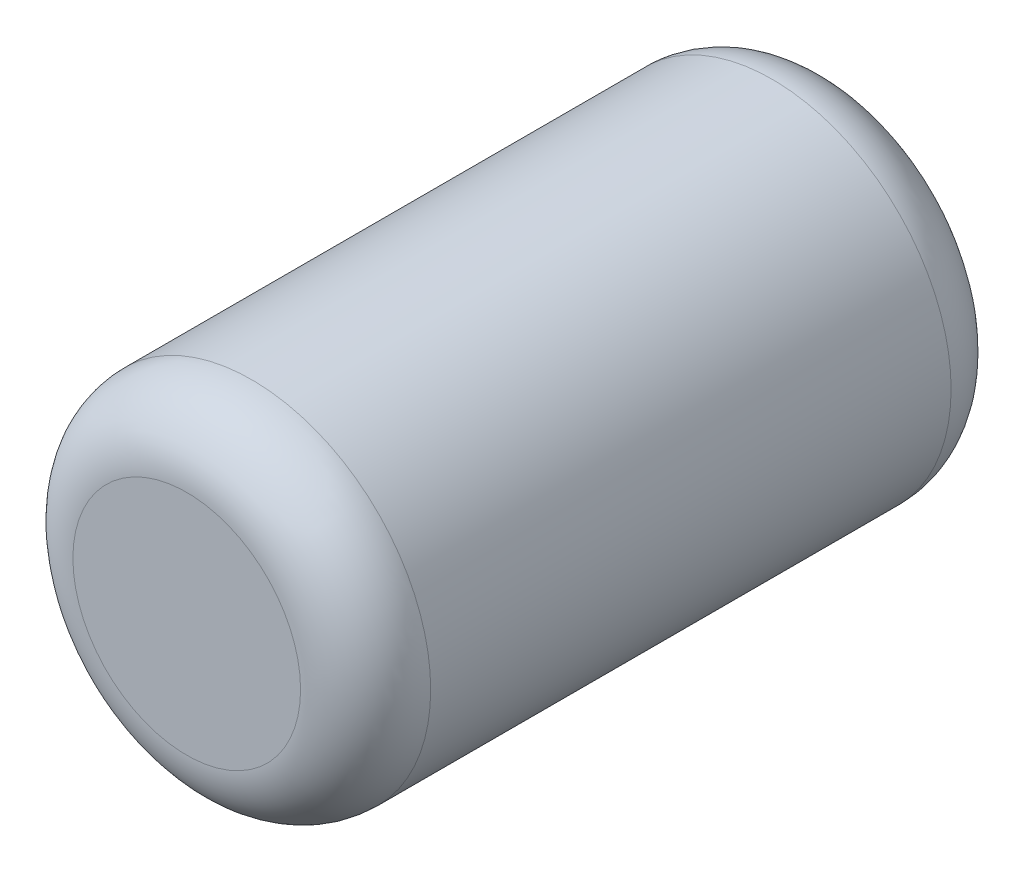
ISO-10303-21;
HEADER;
FILE_DESCRIPTION(('STEP AP214'),'2;1');
FILE_NAME('part.step','',(''),(''),'','','');
FILE_SCHEMA(('AUTOMOTIVE_DESIGN { 1 0 10303 214 1 1 1 1 }'));
ENDSEC;
DATA;
#1=APPLICATION_CONTEXT('core data for automotive mechanical design processes');
#2=APPLICATION_PROTOCOL_DEFINITION('international standard','automotive_design',2000,#1);
#3=PRODUCT_CONTEXT('',#1,'mechanical');
#4=PRODUCT('Part','Part','',(#3));
#5=PRODUCT_RELATED_PRODUCT_CATEGORY('part','',(#4));
#6=PRODUCT_DEFINITION_FORMATION('','',#4);
#7=PRODUCT_DEFINITION_CONTEXT('part definition',#1,'design');
#8=PRODUCT_DEFINITION('design','',#6,#7);
#9=PRODUCT_DEFINITION_SHAPE('','',#8);
#10=(LENGTH_UNIT() NAMED_UNIT(*) SI_UNIT(.MILLI.,.METRE.));
#11=(NAMED_UNIT(*) PLANE_ANGLE_UNIT() SI_UNIT($,.RADIAN.));
#12=(NAMED_UNIT(*) SI_UNIT($,.STERADIAN.) SOLID_ANGLE_UNIT());
#13=UNCERTAINTY_MEASURE_WITH_UNIT(LENGTH_MEASURE(1.E-05),#10,'distance_accuracy_value','');
#14=(GEOMETRIC_REPRESENTATION_CONTEXT(3) GLOBAL_UNCERTAINTY_ASSIGNED_CONTEXT((#13)) GLOBAL_UNIT_ASSIGNED_CONTEXT((#10,
#11,#12)) REPRESENTATION_CONTEXT('',''));
#15=CARTESIAN_POINT('',(0.,0.,0.));
#16=DIRECTION('',(0.,0.,1.));
#17=DIRECTION('',(1.,0.,0.));
#18=AXIS2_PLACEMENT_3D('',#15,#16,#17);
#19=CARTESIAN_POINT('',(0.,0.,127.));
#20=DIRECTION('',(0.,0.,-1.));
#21=DIRECTION('',(-1.,0.,0.));
#22=AXIS2_PLACEMENT_3D('',#19,#20,#21);
#23=CYLINDRICAL_SURFACE('',#22,34.925);
#24=CARTESIAN_POINT('',(0.,0.,12.7));
#25=DIRECTION('',(0.,0.,1.));
#26=DIRECTION('',(1.,0.,0.));
#27=AXIS2_PLACEMENT_3D('',#24,#25,#26);
#28=CIRCLE('',#27,34.925);
#29=CARTESIAN_POINT('',(34.925,0.,12.7));
#30=VERTEX_POINT('',#29);
#31=EDGE_CURVE('E48',#30,#30,#28,.T.);
#32=ORIENTED_EDGE('',*,*,#31,.T.);
#33=EDGE_LOOP('',(#32));
#34=FACE_BOUND('',#33,.T.);
#35=CARTESIAN_POINT('',(0.,0.,114.3));
#36=DIRECTION('',(0.,0.,1.));
#37=DIRECTION('',(1.,0.,0.));
#38=AXIS2_PLACEMENT_3D('',#35,#36,#37);
#39=CIRCLE('',#38,34.925);
#40=CARTESIAN_POINT('',(34.925,0.,114.3));
#41=VERTEX_POINT('',#40);
#42=EDGE_CURVE('E52',#41,#41,#39,.F.);
#43=ORIENTED_EDGE('',*,*,#42,.T.);
#44=EDGE_LOOP('',(#43));
#45=FACE_BOUND('',#44,.T.);
#46=ADVANCED_FACE('F41',(#34,#45),#23,.T.);
#47=CARTESIAN_POINT('',(0.,0.,127.));
#48=DIRECTION('',(0.,0.,1.));
#49=DIRECTION('',(1.,0.,0.));
#50=AXIS2_PLACEMENT_3D('',#47,#48,#49);
#51=PLANE('',#50);
#52=CARTESIAN_POINT('',(0.,0.,127.));
#53=DIRECTION('',(0.,0.,1.));
#54=DIRECTION('',(1.,0.,0.));
#55=AXIS2_PLACEMENT_3D('',#52,#53,#54);
#56=CIRCLE('',#55,22.225);
#57=CARTESIAN_POINT('',(22.225,0.,127.));
#58=VERTEX_POINT('',#57);
#59=EDGE_CURVE('E56',#58,#58,#56,.T.);
#60=ORIENTED_EDGE('',*,*,#59,.T.);
#61=EDGE_LOOP('',(#60));
#62=FACE_BOUND('',#61,.T.);
#63=ADVANCED_FACE('F62',(#62),#51,.T.);
#64=CARTESIAN_POINT('',(0.,0.,0.));
#65=DIRECTION('',(0.,0.,1.));
#66=DIRECTION('',(1.,0.,0.));
#67=AXIS2_PLACEMENT_3D('',#64,#65,#66);
#68=PLANE('',#67);
#69=CARTESIAN_POINT('',(0.,0.,0.));
#70=DIRECTION('',(0.,0.,1.));
#71=DIRECTION('',(1.,0.,0.));
#72=AXIS2_PLACEMENT_3D('',#69,#70,#71);
#73=CIRCLE('',#72,22.225);
#74=CARTESIAN_POINT('',(22.225,0.,0.));
#75=VERTEX_POINT('',#74);
#76=EDGE_CURVE('E10',#75,#75,#73,.F.);
#77=ORIENTED_EDGE('',*,*,#76,.T.);
#78=EDGE_LOOP('',(#77));
#79=FACE_BOUND('',#78,.T.);
#80=ADVANCED_FACE('F66',(#79),#68,.F.);
#81=CARTESIAN_POINT('',(0.,0.,114.3));
#82=DIRECTION('',(0.,0.,1.));
#83=DIRECTION('',(1.,0.,0.));
#84=AXIS2_PLACEMENT_3D('',#81,#82,#83);
#85=TOROIDAL_SURFACE('',#84,22.225,12.7);
#86=ORIENTED_EDGE('',*,*,#42,.F.);
#87=EDGE_LOOP('',(#86));
#88=FACE_BOUND('',#87,.T.);
#89=ORIENTED_EDGE('',*,*,#59,.F.);
#90=EDGE_LOOP('',(#89));
#91=FACE_BOUND('',#90,.T.);
#92=ADVANCED_FACE('F64',(#88,#91),#85,.T.);
#93=CARTESIAN_POINT('',(0.,0.,12.7));
#94=DIRECTION('',(0.,0.,1.));
#95=DIRECTION('',(1.,0.,0.));
#96=AXIS2_PLACEMENT_3D('',#93,#94,#95);
#97=TOROIDAL_SURFACE('',#96,22.225,12.7);
#98=ORIENTED_EDGE('',*,*,#76,.F.);
#99=EDGE_LOOP('',(#98));
#100=FACE_BOUND('',#99,.T.);
#101=ORIENTED_EDGE('',*,*,#31,.F.);
#102=EDGE_LOOP('',(#101));
#103=FACE_BOUND('',#102,.T.);
#104=ADVANCED_FACE('F43',(#100,#103),#97,.T.);
#105=CLOSED_SHELL('',(#46,#63,#80,#92,#104));
#106=MANIFOLD_SOLID_BREP('B2',#105);
#107=ADVANCED_BREP_SHAPE_REPRESENTATION('',(#18,#106),#14);
#108=SHAPE_DEFINITION_REPRESENTATION(#9,#107);
ENDSEC;
END-ISO-10303-21;
